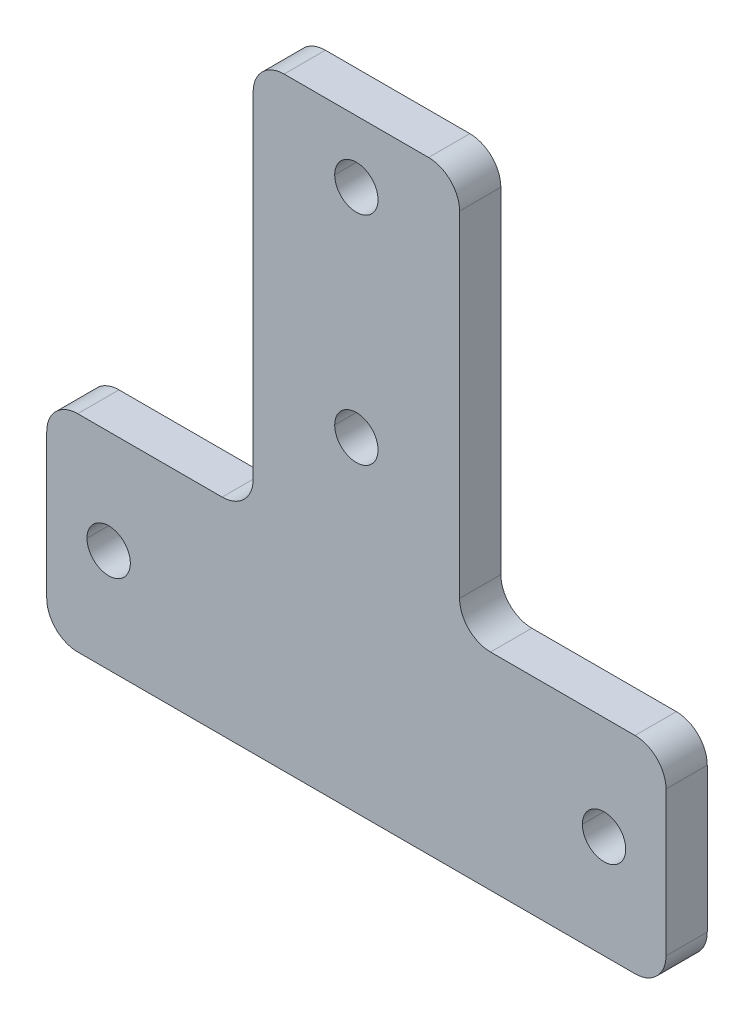
ISO-10303-21;
HEADER;
FILE_DESCRIPTION(('STEP AP214'),'2;1');
FILE_NAME('part.step','',(''),(''),'','','');
FILE_SCHEMA(('AUTOMOTIVE_DESIGN { 1 0 10303 214 1 1 1 1 }'));
ENDSEC;
DATA;
#1=APPLICATION_CONTEXT('core data for automotive mechanical design processes');
#2=APPLICATION_PROTOCOL_DEFINITION('international standard','automotive_design',2000,#1);
#3=PRODUCT_CONTEXT('',#1,'mechanical');
#4=PRODUCT('Part','Part','',(#3));
#5=PRODUCT_RELATED_PRODUCT_CATEGORY('part','',(#4));
#6=PRODUCT_DEFINITION_FORMATION('','',#4);
#7=PRODUCT_DEFINITION_CONTEXT('part definition',#1,'design');
#8=PRODUCT_DEFINITION('design','',#6,#7);
#9=PRODUCT_DEFINITION_SHAPE('','',#8);
#10=(LENGTH_UNIT() NAMED_UNIT(*) SI_UNIT(.MILLI.,.METRE.));
#11=(NAMED_UNIT(*) PLANE_ANGLE_UNIT() SI_UNIT($,.RADIAN.));
#12=(NAMED_UNIT(*) SI_UNIT($,.STERADIAN.) SOLID_ANGLE_UNIT());
#13=UNCERTAINTY_MEASURE_WITH_UNIT(LENGTH_MEASURE(1.E-05),#10,'distance_accuracy_value','');
#14=(GEOMETRIC_REPRESENTATION_CONTEXT(3) GLOBAL_UNCERTAINTY_ASSIGNED_CONTEXT((#13)) GLOBAL_UNIT_ASSIGNED_CONTEXT((#10,
#11,#12)) REPRESENTATION_CONTEXT('',''));
#15=CARTESIAN_POINT('',(0.,0.,0.));
#16=DIRECTION('',(0.,0.,1.));
#17=DIRECTION('',(1.,0.,0.));
#18=AXIS2_PLACEMENT_3D('',#15,#16,#17);
#19=CARTESIAN_POINT('',(12.999999999995,12.999999999967,-4.));
#20=DIRECTION('',(0.,0.,-1.));
#21=DIRECTION('',(-1.,0.,0.));
#22=AXIS2_PLACEMENT_3D('',#19,#20,#21);
#23=CYLINDRICAL_SURFACE('',#22,3.);
#24=CARTESIAN_POINT('',(12.999999999995,12.999999999967,-4.));
#25=DIRECTION('',(0.,0.,1.));
#26=DIRECTION('',(1.,0.,0.));
#27=AXIS2_PLACEMENT_3D('',#24,#25,#26);
#28=CIRCLE('',#27,3.);
#29=CARTESIAN_POINT('',(9.99999999999501,12.9999999999672,-4.));
#30=VERTEX_POINT('',#29);
#31=CARTESIAN_POINT('',(12.999999999995,9.99999999996703,-4.));
#32=VERTEX_POINT('',#31);
#33=EDGE_CURVE('E284',#30,#32,#28,.T.);
#34=ORIENTED_EDGE('',*,*,#33,.F.);
#35=DIRECTION('',(0.,0.,-1.));
#36=VECTOR('',#35,1.);
#37=CARTESIAN_POINT('',(9.99999999999501,12.9999999999672,-4.));
#38=LINE('',#37,#36);
#39=CARTESIAN_POINT('',(9.99999999999501,12.9999999999672,0.));
#40=VERTEX_POINT('',#39);
#41=EDGE_CURVE('E359',#40,#30,#38,.T.);
#42=ORIENTED_EDGE('',*,*,#41,.F.);
#43=CARTESIAN_POINT('',(12.999999999995,12.999999999967,0.));
#44=DIRECTION('',(0.,0.,-1.));
#45=DIRECTION('',(1.,0.,0.));
#46=AXIS2_PLACEMENT_3D('',#43,#44,#45);
#47=CIRCLE('',#46,3.);
#48=CARTESIAN_POINT('',(12.999999999995,9.99999999996703,0.));
#49=VERTEX_POINT('',#48);
#50=EDGE_CURVE('E432',#49,#40,#47,.T.);
#51=ORIENTED_EDGE('',*,*,#50,.F.);
#52=DIRECTION('',(0.,0.,1.));
#53=VECTOR('',#52,1.);
#54=CARTESIAN_POINT('',(12.999999999995,9.99999999996703,0.));
#55=LINE('',#54,#53);
#56=EDGE_CURVE('E388',#32,#49,#55,.T.);
#57=ORIENTED_EDGE('',*,*,#56,.F.);
#58=EDGE_LOOP('',(#34,#42,#51,#57));
#59=FACE_BOUND('',#58,.T.);
#60=ADVANCED_FACE('F17',(#59),#23,.F.);
#61=CARTESIAN_POINT('',(6.99999999999701,45.499999999995,-4.));
#62=DIRECTION('',(0.,0.,1.));
#63=DIRECTION('',(1.,0.,0.));
#64=AXIS2_PLACEMENT_3D('',#61,#62,#63);
#65=CYLINDRICAL_SURFACE('',#64,3.);
#66=CARTESIAN_POINT('',(6.99999999999701,45.499999999995,-4.));
#67=DIRECTION('',(0.,0.,-1.));
#68=DIRECTION('',(1.,1.8503717077086E-13,0.));
#69=AXIS2_PLACEMENT_3D('',#66,#67,#68);
#70=CIRCLE('',#69,3.);
#71=CARTESIAN_POINT('',(6.99999999999701,48.499999999995,-4.));
#72=VERTEX_POINT('',#71);
#73=CARTESIAN_POINT('',(9.99999999999701,45.4999999999948,-4.));
#74=VERTEX_POINT('',#73);
#75=EDGE_CURVE('E281',#72,#74,#70,.T.);
#76=ORIENTED_EDGE('',*,*,#75,.F.);
#77=DIRECTION('',(0.,0.,-1.));
#78=VECTOR('',#77,1.);
#79=CARTESIAN_POINT('',(6.99999999999701,48.499999999995,-4.));
#80=LINE('',#79,#78);
#81=CARTESIAN_POINT('',(6.99999999999701,48.499999999995,0.));
#82=VERTEX_POINT('',#81);
#83=EDGE_CURVE('E350',#82,#72,#80,.T.);
#84=ORIENTED_EDGE('',*,*,#83,.F.);
#85=CARTESIAN_POINT('',(6.99999999999701,45.499999999995,0.));
#86=DIRECTION('',(0.,0.,1.));
#87=DIRECTION('',(1.,0.,0.));
#88=AXIS2_PLACEMENT_3D('',#85,#86,#87);
#89=CIRCLE('',#88,3.);
#90=CARTESIAN_POINT('',(9.99999999999701,45.4999999999948,0.));
#91=VERTEX_POINT('',#90);
#92=EDGE_CURVE('E435',#91,#82,#89,.T.);
#93=ORIENTED_EDGE('',*,*,#92,.F.);
#94=DIRECTION('',(0.,0.,1.));
#95=VECTOR('',#94,1.);
#96=CARTESIAN_POINT('',(9.99999999999701,45.4999999999948,-4.));
#97=LINE('',#96,#95);
#98=EDGE_CURVE('E358',#74,#91,#97,.T.);
#99=ORIENTED_EDGE('',*,*,#98,.F.);
#100=EDGE_LOOP('',(#76,#84,#93,#99));
#101=FACE_BOUND('',#100,.T.);
#102=ADVANCED_FACE('F1067',(#101),#65,.T.);
#103=CARTESIAN_POINT('',(-6.99999999999362,45.499999999995,-4.));
#104=DIRECTION('',(0.,0.,1.));
#105=DIRECTION('',(1.,0.,0.));
#106=AXIS2_PLACEMENT_3D('',#103,#104,#105);
#107=CYLINDRICAL_SURFACE('',#106,3.);
#108=CARTESIAN_POINT('',(-6.99999999999362,45.499999999995,-4.));
#109=DIRECTION('',(0.,0.,-1.));
#110=DIRECTION('',(1.,0.,0.));
#111=AXIS2_PLACEMENT_3D('',#108,#109,#110);
#112=CIRCLE('',#111,3.);
#113=CARTESIAN_POINT('',(-9.99999999999362,45.4999999999949,-4.));
#114=VERTEX_POINT('',#113);
#115=CARTESIAN_POINT('',(-6.99999999999362,48.499999999995,-4.));
#116=VERTEX_POINT('',#115);
#117=EDGE_CURVE('E285',#114,#116,#112,.T.);
#118=ORIENTED_EDGE('',*,*,#117,.F.);
#119=DIRECTION('',(0.,0.,-1.));
#120=VECTOR('',#119,1.);
#121=CARTESIAN_POINT('',(-9.99999999999362,45.4999999999949,-4.));
#122=LINE('',#121,#120);
#123=CARTESIAN_POINT('',(-9.99999999999362,45.4999999999949,0.));
#124=VERTEX_POINT('',#123);
#125=EDGE_CURVE('E379',#124,#114,#122,.T.);
#126=ORIENTED_EDGE('',*,*,#125,.F.);
#127=CARTESIAN_POINT('',(-6.99999999999362,45.499999999995,0.));
#128=DIRECTION('',(0.,0.,1.));
#129=DIRECTION('',(1.,0.,0.));
#130=AXIS2_PLACEMENT_3D('',#127,#128,#129);
#131=CIRCLE('',#130,3.);
#132=CARTESIAN_POINT('',(-6.99999999999362,48.499999999995,0.));
#133=VERTEX_POINT('',#132);
#134=EDGE_CURVE('E38',#133,#124,#131,.T.);
#135=ORIENTED_EDGE('',*,*,#134,.F.);
#136=DIRECTION('',(0.,0.,1.));
#137=VECTOR('',#136,1.);
#138=CARTESIAN_POINT('',(-6.99999999999362,48.499999999995,-4.));
#139=LINE('',#138,#137);
#140=EDGE_CURVE('E332',#116,#133,#139,.T.);
#141=ORIENTED_EDGE('',*,*,#140,.F.);
#142=EDGE_LOOP('',(#118,#126,#135,#141));
#143=FACE_BOUND('',#142,.T.);
#144=ADVANCED_FACE('F958',(#143),#107,.T.);
#145=CARTESIAN_POINT('',(27.0000000000301,6.99999999996703,-4.));
#146=DIRECTION('',(0.,0.,1.));
#147=DIRECTION('',(1.,0.,0.));
#148=AXIS2_PLACEMENT_3D('',#145,#146,#147);
#149=CYLINDRICAL_SURFACE('',#148,3.);
#150=CARTESIAN_POINT('',(27.0000000000301,6.99999999996703,-4.));
#151=DIRECTION('',(0.,0.,-1.));
#152=DIRECTION('',(1.,0.,0.));
#153=AXIS2_PLACEMENT_3D('',#150,#151,#152);
#154=CIRCLE('',#153,3.);
#155=CARTESIAN_POINT('',(27.0000000000301,9.99999999996703,-4.));
#156=VERTEX_POINT('',#155);
#157=CARTESIAN_POINT('',(30.0000000000301,6.99999999996695,-4.));
#158=VERTEX_POINT('',#157);
#159=EDGE_CURVE('E478',#156,#158,#154,.T.);
#160=ORIENTED_EDGE('',*,*,#159,.F.);
#161=DIRECTION('',(0.,0.,-1.));
#162=VECTOR('',#161,1.);
#163=CARTESIAN_POINT('',(27.0000000000301,9.99999999996703,-4.));
#164=LINE('',#163,#162);
#165=CARTESIAN_POINT('',(27.0000000000301,9.99999999996703,0.));
#166=VERTEX_POINT('',#165);
#167=EDGE_CURVE('E374',#166,#156,#164,.T.);
#168=ORIENTED_EDGE('',*,*,#167,.F.);
#169=CARTESIAN_POINT('',(27.0000000000301,6.99999999996703,0.));
#170=DIRECTION('',(0.,0.,1.));
#171=DIRECTION('',(1.,0.,0.));
#172=AXIS2_PLACEMENT_3D('',#169,#170,#171);
#173=CIRCLE('',#172,3.);
#174=CARTESIAN_POINT('',(30.0000000000301,6.99999999996695,0.));
#175=VERTEX_POINT('',#174);
#176=EDGE_CURVE('E436',#175,#166,#173,.T.);
#177=ORIENTED_EDGE('',*,*,#176,.F.);
#178=DIRECTION('',(0.,0.,1.));
#179=VECTOR('',#178,1.);
#180=CARTESIAN_POINT('',(30.0000000000301,6.99999999996695,-4.));
#181=LINE('',#180,#179);
#182=EDGE_CURVE('E407',#158,#175,#181,.T.);
#183=ORIENTED_EDGE('',*,*,#182,.F.);
#184=EDGE_LOOP('',(#160,#168,#177,#183));
#185=FACE_BOUND('',#184,.T.);
#186=ADVANCED_FACE('F953',(#185),#149,.T.);
#187=CARTESIAN_POINT('',(27.0000000000297,-6.9999999999933,-4.));
#188=DIRECTION('',(0.,0.,1.));
#189=DIRECTION('',(1.,0.,0.));
#190=AXIS2_PLACEMENT_3D('',#187,#188,#189);
#191=CYLINDRICAL_SURFACE('',#190,3.);
#192=CARTESIAN_POINT('',(27.0000000000297,-6.9999999999933,-4.));
#193=DIRECTION('',(0.,0.,-1.));
#194=DIRECTION('',(1.,0.,0.));
#195=AXIS2_PLACEMENT_3D('',#192,#193,#194);
#196=CIRCLE('',#195,3.);
#197=CARTESIAN_POINT('',(30.0000000000297,-6.99999999999337,-4.));
#198=VERTEX_POINT('',#197);
#199=CARTESIAN_POINT('',(27.0000000000298,-9.99999999999329,-4.));
#200=VERTEX_POINT('',#199);
#201=EDGE_CURVE('E245',#198,#200,#196,.T.);
#202=ORIENTED_EDGE('',*,*,#201,.F.);
#203=DIRECTION('',(0.,0.,-1.));
#204=VECTOR('',#203,1.);
#205=CARTESIAN_POINT('',(30.0000000000297,-6.99999999999337,-4.));
#206=LINE('',#205,#204);
#207=CARTESIAN_POINT('',(30.0000000000297,-6.99999999999337,0.));
#208=VERTEX_POINT('',#207);
#209=EDGE_CURVE('E399',#208,#198,#206,.T.);
#210=ORIENTED_EDGE('',*,*,#209,.F.);
#211=CARTESIAN_POINT('',(27.0000000000297,-6.9999999999933,0.));
#212=DIRECTION('',(0.,0.,1.));
#213=DIRECTION('',(1.,0.,0.));
#214=AXIS2_PLACEMENT_3D('',#211,#212,#213);
#215=CIRCLE('',#214,3.);
#216=CARTESIAN_POINT('',(27.0000000000298,-9.99999999999329,0.));
#217=VERTEX_POINT('',#216);
#218=EDGE_CURVE('E319',#217,#208,#215,.T.);
#219=ORIENTED_EDGE('',*,*,#218,.F.);
#220=DIRECTION('',(0.,0.,1.));
#221=VECTOR('',#220,1.);
#222=CARTESIAN_POINT('',(27.0000000000298,-9.99999999999329,-4.));
#223=LINE('',#222,#221);
#224=EDGE_CURVE('E340',#200,#217,#223,.T.);
#225=ORIENTED_EDGE('',*,*,#224,.F.);
#226=EDGE_LOOP('',(#202,#210,#219,#225));
#227=FACE_BOUND('',#226,.T.);
#228=ADVANCED_FACE('F957',(#227),#191,.T.);
#229=CARTESIAN_POINT('',(-12.9999999999927,12.999999999967,-4.));
#230=DIRECTION('',(0.,0.,-1.));
#231=DIRECTION('',(-1.,0.,0.));
#232=AXIS2_PLACEMENT_3D('',#229,#230,#231);
#233=CYLINDRICAL_SURFACE('',#232,3.);
#234=CARTESIAN_POINT('',(-12.9999999999927,12.999999999967,-4.));
#235=DIRECTION('',(0.,0.,1.));
#236=DIRECTION('',(1.,0.,0.));
#237=AXIS2_PLACEMENT_3D('',#234,#235,#236);
#238=CIRCLE('',#237,3.);
#239=CARTESIAN_POINT('',(-12.9999999999927,9.99999999996703,-4.));
#240=VERTEX_POINT('',#239);
#241=CARTESIAN_POINT('',(-9.99999999999272,12.9999999999671,-4.));
#242=VERTEX_POINT('',#241);
#243=EDGE_CURVE('E454',#240,#242,#238,.T.);
#244=ORIENTED_EDGE('',*,*,#243,.F.);
#245=DIRECTION('',(0.,0.,-1.));
#246=VECTOR('',#245,1.);
#247=CARTESIAN_POINT('',(-12.9999999999927,9.99999999996703,-4.));
#248=LINE('',#247,#246);
#249=CARTESIAN_POINT('',(-12.9999999999927,9.99999999996703,0.));
#250=VERTEX_POINT('',#249);
#251=EDGE_CURVE('E449',#250,#240,#248,.T.);
#252=ORIENTED_EDGE('',*,*,#251,.F.);
#253=CARTESIAN_POINT('',(-12.9999999999927,12.999999999967,0.));
#254=DIRECTION('',(0.,0.,-1.));
#255=DIRECTION('',(1.,0.,0.));
#256=AXIS2_PLACEMENT_3D('',#253,#254,#255);
#257=CIRCLE('',#256,3.);
#258=CARTESIAN_POINT('',(-9.99999999999272,12.9999999999671,0.));
#259=VERTEX_POINT('',#258);
#260=EDGE_CURVE('E49',#259,#250,#257,.T.);
#261=ORIENTED_EDGE('',*,*,#260,.F.);
#262=DIRECTION('',(0.,0.,1.));
#263=VECTOR('',#262,1.);
#264=CARTESIAN_POINT('',(-9.99999999999272,12.9999999999671,0.));
#265=LINE('',#264,#263);
#266=EDGE_CURVE('E395',#242,#259,#265,.T.);
#267=ORIENTED_EDGE('',*,*,#266,.F.);
#268=EDGE_LOOP('',(#244,#252,#261,#267));
#269=FACE_BOUND('',#268,.T.);
#270=ADVANCED_FACE('F993',(#269),#233,.F.);
#271=CARTESIAN_POINT('',(-26.9999999999716,6.99999999996703,-4.));
#272=DIRECTION('',(0.,0.,1.));
#273=DIRECTION('',(1.,0.,0.));
#274=AXIS2_PLACEMENT_3D('',#271,#272,#273);
#275=CYLINDRICAL_SURFACE('',#274,3.);
#276=CARTESIAN_POINT('',(-26.9999999999716,6.99999999996703,-4.));
#277=DIRECTION('',(0.,0.,-1.));
#278=DIRECTION('',(1.,0.,0.));
#279=AXIS2_PLACEMENT_3D('',#276,#277,#278);
#280=CIRCLE('',#279,3.);
#281=CARTESIAN_POINT('',(-29.9999999999716,6.99999999996716,-4.));
#282=VERTEX_POINT('',#281);
#283=CARTESIAN_POINT('',(-26.9999999999716,9.99999999996703,-4.));
#284=VERTEX_POINT('',#283);
#285=EDGE_CURVE('E457',#282,#284,#280,.T.);
#286=ORIENTED_EDGE('',*,*,#285,.F.);
#287=DIRECTION('',(0.,0.,-1.));
#288=VECTOR('',#287,1.);
#289=CARTESIAN_POINT('',(-29.9999999999716,6.99999999996716,-4.));
#290=LINE('',#289,#288);
#291=CARTESIAN_POINT('',(-29.9999999999716,6.99999999996716,0.));
#292=VERTEX_POINT('',#291);
#293=EDGE_CURVE('E266',#292,#282,#290,.T.);
#294=ORIENTED_EDGE('',*,*,#293,.F.);
#295=CARTESIAN_POINT('',(-26.9999999999716,6.99999999996703,0.));
#296=DIRECTION('',(0.,0.,1.));
#297=DIRECTION('',(1.,0.,0.));
#298=AXIS2_PLACEMENT_3D('',#295,#296,#297);
#299=CIRCLE('',#298,3.);
#300=CARTESIAN_POINT('',(-26.9999999999716,9.99999999996703,0.));
#301=VERTEX_POINT('',#300);
#302=EDGE_CURVE('E431',#301,#292,#299,.T.);
#303=ORIENTED_EDGE('',*,*,#302,.F.);
#304=DIRECTION('',(0.,0.,1.));
#305=VECTOR('',#304,1.);
#306=CARTESIAN_POINT('',(-26.9999999999716,9.99999999996703,-4.));
#307=LINE('',#306,#305);
#308=EDGE_CURVE('E441',#284,#301,#307,.T.);
#309=ORIENTED_EDGE('',*,*,#308,.F.);
#310=EDGE_LOOP('',(#286,#294,#303,#309));
#311=FACE_BOUND('',#310,.T.);
#312=ADVANCED_FACE('F1036',(#311),#275,.T.);
#313=CARTESIAN_POINT('',(-26.9999999999722,-6.99999999999534,-4.));
#314=DIRECTION('',(0.,0.,1.));
#315=DIRECTION('',(1.,0.,0.));
#316=AXIS2_PLACEMENT_3D('',#313,#314,#315);
#317=CYLINDRICAL_SURFACE('',#316,3.);
#318=CARTESIAN_POINT('',(-26.9999999999722,-6.99999999999534,-4.));
#319=DIRECTION('',(0.,0.,-1.));
#320=DIRECTION('',(1.,0.,0.));
#321=AXIS2_PLACEMENT_3D('',#318,#319,#320);
#322=CIRCLE('',#321,3.);
#323=CARTESIAN_POINT('',(-26.9999999999721,-9.99999999999534,-4.));
#324=VERTEX_POINT('',#323);
#325=CARTESIAN_POINT('',(-29.9999999999722,-6.99999999999521,-4.));
#326=VERTEX_POINT('',#325);
#327=EDGE_CURVE('E383',#324,#326,#322,.T.);
#328=ORIENTED_EDGE('',*,*,#327,.F.);
#329=DIRECTION('',(0.,0.,-1.));
#330=VECTOR('',#329,1.);
#331=CARTESIAN_POINT('',(-26.9999999999721,-9.99999999999534,-4.));
#332=LINE('',#331,#330);
#333=CARTESIAN_POINT('',(-26.9999999999721,-9.99999999999534,0.));
#334=VERTEX_POINT('',#333);
#335=EDGE_CURVE('E418',#334,#324,#332,.T.);
#336=ORIENTED_EDGE('',*,*,#335,.F.);
#337=CARTESIAN_POINT('',(-26.9999999999722,-6.99999999999534,0.));
#338=DIRECTION('',(0.,0.,1.));
#339=DIRECTION('',(1.,0.,0.));
#340=AXIS2_PLACEMENT_3D('',#337,#338,#339);
#341=CIRCLE('',#340,3.);
#342=CARTESIAN_POINT('',(-29.9999999999722,-6.99999999999521,0.));
#343=VERTEX_POINT('',#342);
#344=EDGE_CURVE('E316',#343,#334,#341,.T.);
#345=ORIENTED_EDGE('',*,*,#344,.F.);
#346=DIRECTION('',(0.,0.,1.));
#347=VECTOR('',#346,1.);
#348=CARTESIAN_POINT('',(-29.9999999999722,-6.99999999999521,-4.));
#349=LINE('',#348,#347);
#350=EDGE_CURVE('E306',#326,#343,#349,.T.);
#351=ORIENTED_EDGE('',*,*,#350,.F.);
#352=EDGE_LOOP('',(#328,#336,#345,#351));
#353=FACE_BOUND('',#352,.T.);
#354=ADVANCED_FACE('F1032',(#353),#317,.T.);
#355=CARTESIAN_POINT('',(24.0000000000022,0.,-4.));
#356=DIRECTION('',(0.,0.,1.));
#357=DIRECTION('',(1.,0.,0.));
#358=AXIS2_PLACEMENT_3D('',#355,#356,#357);
#359=CYLINDRICAL_SURFACE('',#358,2.1);
#360=DIRECTION('',(0.,0.,1.));
#361=VECTOR('',#360,1.);
#362=CARTESIAN_POINT('',(21.9000000000022,0.,-4.));
#363=LINE('',#362,#361);
#364=CARTESIAN_POINT('',(21.9000000000022,0.,-4.));
#365=VERTEX_POINT('',#364);
#366=CARTESIAN_POINT('',(21.9000000000022,0.,0.));
#367=VERTEX_POINT('',#366);
#368=EDGE_CURVE('E248',#365,#367,#363,.T.);
#369=ORIENTED_EDGE('',*,*,#368,.F.);
#370=CARTESIAN_POINT('',(24.0000000000022,0.,-4.));
#371=DIRECTION('',(0.,0.,1.));
#372=DIRECTION('',(1.,0.,0.));
#373=AXIS2_PLACEMENT_3D('',#370,#371,#372);
#374=CIRCLE('',#373,2.1);
#375=CARTESIAN_POINT('',(26.1000000000022,0.,-4.));
#376=VERTEX_POINT('',#375);
#377=EDGE_CURVE('E234',#376,#365,#374,.T.);
#378=ORIENTED_EDGE('',*,*,#377,.F.);
#379=DIRECTION('',(0.,0.,1.));
#380=VECTOR('',#379,1.);
#381=CARTESIAN_POINT('',(26.1000000000022,0.,-4.));
#382=LINE('',#381,#380);
#383=CARTESIAN_POINT('',(26.1000000000022,0.,0.));
#384=VERTEX_POINT('',#383);
#385=EDGE_CURVE('E258',#376,#384,#382,.T.);
#386=ORIENTED_EDGE('',*,*,#385,.T.);
#387=CARTESIAN_POINT('',(24.0000000000022,0.,0.));
#388=DIRECTION('',(0.,0.,1.));
#389=DIRECTION('',(1.,0.,0.));
#390=AXIS2_PLACEMENT_3D('',#387,#388,#389);
#391=CIRCLE('',#390,2.1);
#392=EDGE_CURVE('E250',#384,#367,#391,.T.);
#393=ORIENTED_EDGE('',*,*,#392,.T.);
#394=EDGE_LOOP('',(#369,#378,#386,#393));
#395=FACE_BOUND('',#394,.T.);
#396=ADVANCED_FACE('F249',(#395),#359,.F.);
#397=CARTESIAN_POINT('',(-23.9999999999987,0.,-4.));
#398=DIRECTION('',(0.,0.,1.));
#399=DIRECTION('',(1.,0.,0.));
#400=AXIS2_PLACEMENT_3D('',#397,#398,#399);
#401=CYLINDRICAL_SURFACE('',#400,2.1);
#402=DIRECTION('',(0.,0.,1.));
#403=VECTOR('',#402,1.);
#404=CARTESIAN_POINT('',(-26.0999999999987,0.,-4.));
#405=LINE('',#404,#403);
#406=CARTESIAN_POINT('',(-26.0999999999987,0.,-4.));
#407=VERTEX_POINT('',#406);
#408=CARTESIAN_POINT('',(-26.0999999999987,0.,0.));
#409=VERTEX_POINT('',#408);
#410=EDGE_CURVE('E267',#407,#409,#405,.T.);
#411=ORIENTED_EDGE('',*,*,#410,.F.);
#412=CARTESIAN_POINT('',(-23.9999999999987,0.,-4.));
#413=DIRECTION('',(0.,0.,1.));
#414=DIRECTION('',(1.,0.,0.));
#415=AXIS2_PLACEMENT_3D('',#412,#413,#414);
#416=CIRCLE('',#415,2.1);
#417=CARTESIAN_POINT('',(-21.8999999999987,0.,-4.));
#418=VERTEX_POINT('',#417);
#419=EDGE_CURVE('E244',#418,#407,#416,.T.);
#420=ORIENTED_EDGE('',*,*,#419,.F.);
#421=DIRECTION('',(0.,0.,1.));
#422=VECTOR('',#421,1.);
#423=CARTESIAN_POINT('',(-21.8999999999987,0.,-4.));
#424=LINE('',#423,#422);
#425=CARTESIAN_POINT('',(-21.8999999999987,0.,0.));
#426=VERTEX_POINT('',#425);
#427=EDGE_CURVE('E276',#418,#426,#424,.T.);
#428=ORIENTED_EDGE('',*,*,#427,.T.);
#429=CARTESIAN_POINT('',(-23.9999999999987,0.,0.));
#430=DIRECTION('',(0.,0.,1.));
#431=DIRECTION('',(1.,0.,0.));
#432=AXIS2_PLACEMENT_3D('',#429,#430,#431);
#433=CIRCLE('',#432,2.1);
#434=EDGE_CURVE('E470',#426,#409,#433,.T.);
#435=ORIENTED_EDGE('',*,*,#434,.T.);
#436=EDGE_LOOP('',(#411,#420,#428,#435));
#437=FACE_BOUND('',#436,.T.);
#438=ADVANCED_FACE('F1018',(#437),#401,.F.);
#439=CARTESIAN_POINT('',(0.,21.5000000000016,-4.));
#440=DIRECTION('',(0.,0.,1.));
#441=DIRECTION('',(1.,0.,0.));
#442=AXIS2_PLACEMENT_3D('',#439,#440,#441);
#443=CYLINDRICAL_SURFACE('',#442,2.1);
#444=DIRECTION('',(0.,0.,1.));
#445=VECTOR('',#444,1.);
#446=CARTESIAN_POINT('',(-2.10000000000004,21.5000000000016,-4.));
#447=LINE('',#446,#445);
#448=CARTESIAN_POINT('',(-2.10000000000004,21.5000000000016,-4.));
#449=VERTEX_POINT('',#448);
#450=CARTESIAN_POINT('',(-2.10000000000004,21.5000000000016,0.));
#451=VERTEX_POINT('',#450);
#452=EDGE_CURVE('E294',#449,#451,#447,.T.);
#453=ORIENTED_EDGE('',*,*,#452,.F.);
#454=CARTESIAN_POINT('',(0.,21.5000000000016,-4.));
#455=DIRECTION('',(0.,0.,1.));
#456=DIRECTION('',(1.,0.,0.));
#457=AXIS2_PLACEMENT_3D('',#454,#455,#456);
#458=CIRCLE('',#457,2.1);
#459=CARTESIAN_POINT('',(2.09999999999996,21.5000000000016,-4.));
#460=VERTEX_POINT('',#459);
#461=EDGE_CURVE('E473',#460,#449,#458,.T.);
#462=ORIENTED_EDGE('',*,*,#461,.F.);
#463=DIRECTION('',(0.,0.,1.));
#464=VECTOR('',#463,1.);
#465=CARTESIAN_POINT('',(2.09999999999996,21.5000000000016,-4.));
#466=LINE('',#465,#464);
#467=CARTESIAN_POINT('',(2.09999999999996,21.5000000000016,0.));
#468=VERTEX_POINT('',#467);
#469=EDGE_CURVE('E293',#460,#468,#466,.T.);
#470=ORIENTED_EDGE('',*,*,#469,.T.);
#471=CARTESIAN_POINT('',(0.,21.5000000000016,0.));
#472=DIRECTION('',(0.,0.,1.));
#473=DIRECTION('',(1.,0.,0.));
#474=AXIS2_PLACEMENT_3D('',#471,#472,#473);
#475=CIRCLE('',#474,2.1);
#476=EDGE_CURVE('E25',#468,#451,#475,.T.);
#477=ORIENTED_EDGE('',*,*,#476,.T.);
#478=EDGE_LOOP('',(#453,#462,#470,#477));
#479=FACE_BOUND('',#478,.T.);
#480=ADVANCED_FACE('F911',(#479),#443,.F.);
#481=CARTESIAN_POINT('',(0.,42.4999999999949,-4.));
#482=DIRECTION('',(0.,0.,1.));
#483=DIRECTION('',(1.,0.,0.));
#484=AXIS2_PLACEMENT_3D('',#481,#482,#483);
#485=CYLINDRICAL_SURFACE('',#484,2.1);
#486=DIRECTION('',(0.,0.,1.));
#487=VECTOR('',#486,1.);
#488=CARTESIAN_POINT('',(-2.10000000000007,42.4999999999949,-4.));
#489=LINE('',#488,#487);
#490=CARTESIAN_POINT('',(-2.10000000000007,42.4999999999949,-4.));
#491=VERTEX_POINT('',#490);
#492=CARTESIAN_POINT('',(-2.10000000000007,42.4999999999949,0.));
#493=VERTEX_POINT('',#492);
#494=EDGE_CURVE('E328',#491,#493,#489,.T.);
#495=ORIENTED_EDGE('',*,*,#494,.F.);
#496=CARTESIAN_POINT('',(0.,42.4999999999949,-4.));
#497=DIRECTION('',(0.,0.,1.));
#498=DIRECTION('',(1.,0.,0.));
#499=AXIS2_PLACEMENT_3D('',#496,#497,#498);
#500=CIRCLE('',#499,2.1);
#501=CARTESIAN_POINT('',(2.09999999999993,42.4999999999949,-4.));
#502=VERTEX_POINT('',#501);
#503=EDGE_CURVE('E320',#502,#491,#500,.T.);
#504=ORIENTED_EDGE('',*,*,#503,.F.);
#505=DIRECTION('',(0.,0.,1.));
#506=VECTOR('',#505,1.);
#507=CARTESIAN_POINT('',(2.09999999999993,42.4999999999949,-4.));
#508=LINE('',#507,#506);
#509=CARTESIAN_POINT('',(2.09999999999993,42.4999999999949,0.));
#510=VERTEX_POINT('',#509);
#511=EDGE_CURVE('E310',#502,#510,#508,.T.);
#512=ORIENTED_EDGE('',*,*,#511,.T.);
#513=CARTESIAN_POINT('',(0.,42.4999999999949,0.));
#514=DIRECTION('',(0.,0.,1.));
#515=DIRECTION('',(1.,0.,0.));
#516=AXIS2_PLACEMENT_3D('',#513,#514,#515);
#517=CIRCLE('',#516,2.1);
#518=EDGE_CURVE('E11',#510,#493,#517,.T.);
#519=ORIENTED_EDGE('',*,*,#518,.T.);
#520=EDGE_LOOP('',(#495,#504,#512,#519));
#521=FACE_BOUND('',#520,.T.);
#522=ADVANCED_FACE('F907',(#521),#485,.F.);
#523=CARTESIAN_POINT('',(0.,0.,0.));
#524=DIRECTION('',(0.,0.,1.));
#525=DIRECTION('',(1.,0.,0.));
#526=AXIS2_PLACEMENT_3D('',#523,#524,#525);
#527=PLANE('',#526);
#528=ORIENTED_EDGE('',*,*,#518,.F.);
#529=CARTESIAN_POINT('',(0.,42.4999999999949,0.));
#530=DIRECTION('',(0.,0.,1.));
#531=DIRECTION('',(1.,0.,0.));
#532=AXIS2_PLACEMENT_3D('',#529,#530,#531);
#533=CIRCLE('',#532,2.1);
#534=EDGE_CURVE('E315',#493,#510,#533,.T.);
#535=ORIENTED_EDGE('',*,*,#534,.F.);
#536=EDGE_LOOP('',(#528,#535));
#537=FACE_BOUND('',#536,.T.);
#538=ORIENTED_EDGE('',*,*,#476,.F.);
#539=CARTESIAN_POINT('',(0.,21.5000000000016,0.));
#540=DIRECTION('',(0.,0.,1.));
#541=DIRECTION('',(1.,0.,0.));
#542=AXIS2_PLACEMENT_3D('',#539,#540,#541);
#543=CIRCLE('',#542,2.1);
#544=EDGE_CURVE('E289',#451,#468,#543,.T.);
#545=ORIENTED_EDGE('',*,*,#544,.F.);
#546=EDGE_LOOP('',(#538,#545));
#547=FACE_BOUND('',#546,.T.);
#548=ORIENTED_EDGE('',*,*,#434,.F.);
#549=CARTESIAN_POINT('',(-23.9999999999987,0.,0.));
#550=DIRECTION('',(0.,0.,1.));
#551=DIRECTION('',(1.,0.,0.));
#552=AXIS2_PLACEMENT_3D('',#549,#550,#551);
#553=CIRCLE('',#552,2.1);
#554=EDGE_CURVE('E270',#409,#426,#553,.T.);
#555=ORIENTED_EDGE('',*,*,#554,.F.);
#556=EDGE_LOOP('',(#548,#555));
#557=FACE_BOUND('',#556,.T.);
#558=ORIENTED_EDGE('',*,*,#392,.F.);
#559=CARTESIAN_POINT('',(24.0000000000022,0.,0.));
#560=DIRECTION('',(0.,0.,1.));
#561=DIRECTION('',(1.,0.,0.));
#562=AXIS2_PLACEMENT_3D('',#559,#560,#561);
#563=CIRCLE('',#562,2.1);
#564=EDGE_CURVE('E255',#367,#384,#563,.T.);
#565=ORIENTED_EDGE('',*,*,#564,.F.);
#566=EDGE_LOOP('',(#558,#565));
#567=FACE_BOUND('',#566,.T.);
#568=DIRECTION('',(0.,-1.,0.));
#569=VECTOR('',#568,1.);
#570=CARTESIAN_POINT('',(-29.9999999999723,-9.99999999999546,0.));
#571=LINE('',#570,#569);
#572=EDGE_CURVE('E302',#292,#343,#571,.T.);
#573=ORIENTED_EDGE('',*,*,#572,.T.);
#574=ORIENTED_EDGE('',*,*,#344,.T.);
#575=DIRECTION('',(1.,0.,0.));
#576=VECTOR('',#575,1.);
#577=CARTESIAN_POINT('',(-29.9999999999723,-9.99999999999546,0.));
#578=LINE('',#577,#576);
#579=EDGE_CURVE('E411',#334,#217,#578,.T.);
#580=ORIENTED_EDGE('',*,*,#579,.T.);
#581=ORIENTED_EDGE('',*,*,#218,.T.);
#582=DIRECTION('',(0.,1.,0.));
#583=VECTOR('',#582,1.);
#584=CARTESIAN_POINT('',(30.0000000000296,-9.99999999999318,0.));
#585=LINE('',#584,#583);
#586=EDGE_CURVE('E392',#208,#175,#585,.T.);
#587=ORIENTED_EDGE('',*,*,#586,.T.);
#588=ORIENTED_EDGE('',*,*,#176,.T.);
#589=DIRECTION('',(-1.,0.,0.));
#590=VECTOR('',#589,1.);
#591=CARTESIAN_POINT('',(9.99999999999482,9.99999999996703,0.));
#592=LINE('',#591,#590);
#593=EDGE_CURVE('E363',#166,#49,#592,.T.);
#594=ORIENTED_EDGE('',*,*,#593,.T.);
#595=ORIENTED_EDGE('',*,*,#50,.T.);
#596=DIRECTION('',(0.,1.,0.));
#597=VECTOR('',#596,1.);
#598=CARTESIAN_POINT('',(9.99999999999482,9.99999999996703,0.));
#599=LINE('',#598,#597);
#600=EDGE_CURVE('E364',#40,#91,#599,.T.);
#601=ORIENTED_EDGE('',*,*,#600,.T.);
#602=ORIENTED_EDGE('',*,*,#92,.T.);
#603=DIRECTION('',(-1.,0.,0.));
#604=VECTOR('',#603,1.);
#605=CARTESIAN_POINT('',(-9.99999999999371,48.499999999995,0.));
#606=LINE('',#605,#604);
#607=EDGE_CURVE('E347',#82,#133,#606,.T.);
#608=ORIENTED_EDGE('',*,*,#607,.T.);
#609=ORIENTED_EDGE('',*,*,#134,.T.);
#610=DIRECTION('',(0.,-1.,0.));
#611=VECTOR('',#610,1.);
#612=CARTESIAN_POINT('',(-9.99999999999264,9.99999999996703,0.));
#613=LINE('',#612,#611);
#614=EDGE_CURVE('E384',#124,#259,#613,.T.);
#615=ORIENTED_EDGE('',*,*,#614,.T.);
#616=ORIENTED_EDGE('',*,*,#260,.T.);
#617=DIRECTION('',(-1.,0.,0.));
#618=VECTOR('',#617,1.);
#619=CARTESIAN_POINT('',(-29.9999999999715,9.99999999996703,0.));
#620=LINE('',#619,#618);
#621=EDGE_CURVE('E445',#250,#301,#620,.T.);
#622=ORIENTED_EDGE('',*,*,#621,.T.);
#623=ORIENTED_EDGE('',*,*,#302,.T.);
#624=EDGE_LOOP('',(#573,#574,#580,#581,#587,#588,#594,#595,#601,#602,#608,#609,#615,#616,#622,#623));
#625=FACE_BOUND('',#624,.T.);
#626=ADVANCED_FACE('F901',(#537,#547,#557,#567,#625),#527,.T.);
#627=CARTESIAN_POINT('',(0.,0.,-4.));
#628=DIRECTION('',(0.,0.,1.));
#629=DIRECTION('',(1.,0.,0.));
#630=AXIS2_PLACEMENT_3D('',#627,#628,#629);
#631=PLANE('',#630);
#632=ORIENTED_EDGE('',*,*,#503,.T.);
#633=CARTESIAN_POINT('',(0.,42.4999999999949,-4.));
#634=DIRECTION('',(0.,0.,1.));
#635=DIRECTION('',(1.,0.,0.));
#636=AXIS2_PLACEMENT_3D('',#633,#634,#635);
#637=CIRCLE('',#636,2.1);
#638=EDGE_CURVE('E324',#491,#502,#637,.T.);
#639=ORIENTED_EDGE('',*,*,#638,.T.);
#640=EDGE_LOOP('',(#632,#639));
#641=FACE_BOUND('',#640,.T.);
#642=ORIENTED_EDGE('',*,*,#461,.T.);
#643=CARTESIAN_POINT('',(0.,21.5000000000016,-4.));
#644=DIRECTION('',(0.,0.,1.));
#645=DIRECTION('',(1.,0.,0.));
#646=AXIS2_PLACEMENT_3D('',#643,#644,#645);
#647=CIRCLE('',#646,2.1);
#648=EDGE_CURVE('E298',#449,#460,#647,.T.);
#649=ORIENTED_EDGE('',*,*,#648,.T.);
#650=EDGE_LOOP('',(#642,#649));
#651=FACE_BOUND('',#650,.T.);
#652=ORIENTED_EDGE('',*,*,#419,.T.);
#653=CARTESIAN_POINT('',(-23.9999999999987,0.,-4.));
#654=DIRECTION('',(0.,0.,1.));
#655=DIRECTION('',(1.,0.,0.));
#656=AXIS2_PLACEMENT_3D('',#653,#654,#655);
#657=CIRCLE('',#656,2.1);
#658=EDGE_CURVE('E271',#407,#418,#657,.T.);
#659=ORIENTED_EDGE('',*,*,#658,.T.);
#660=EDGE_LOOP('',(#652,#659));
#661=FACE_BOUND('',#660,.T.);
#662=ORIENTED_EDGE('',*,*,#377,.T.);
#663=CARTESIAN_POINT('',(24.0000000000022,0.,-4.));
#664=DIRECTION('',(0.,0.,1.));
#665=DIRECTION('',(1.,0.,0.));
#666=AXIS2_PLACEMENT_3D('',#663,#664,#665);
#667=CIRCLE('',#666,2.1);
#668=EDGE_CURVE('E239',#365,#376,#667,.T.);
#669=ORIENTED_EDGE('',*,*,#668,.T.);
#670=EDGE_LOOP('',(#662,#669));
#671=FACE_BOUND('',#670,.T.);
#672=DIRECTION('',(1.,0.,0.));
#673=VECTOR('',#672,1.);
#674=CARTESIAN_POINT('',(-29.9999999999723,-9.99999999999546,-4.));
#675=LINE('',#674,#673);
#676=EDGE_CURVE('E422',#324,#200,#675,.T.);
#677=ORIENTED_EDGE('',*,*,#676,.F.);
#678=ORIENTED_EDGE('',*,*,#327,.T.);
#679=DIRECTION('',(0.,-1.,0.));
#680=VECTOR('',#679,1.);
#681=CARTESIAN_POINT('',(-29.9999999999723,-9.99999999999546,-4.));
#682=LINE('',#681,#680);
#683=EDGE_CURVE('E336',#282,#326,#682,.T.);
#684=ORIENTED_EDGE('',*,*,#683,.F.);
#685=ORIENTED_EDGE('',*,*,#285,.T.);
#686=DIRECTION('',(-1.,0.,0.));
#687=VECTOR('',#686,1.);
#688=CARTESIAN_POINT('',(-29.9999999999715,9.99999999996703,-4.));
#689=LINE('',#688,#687);
#690=EDGE_CURVE('E437',#240,#284,#689,.T.);
#691=ORIENTED_EDGE('',*,*,#690,.F.);
#692=ORIENTED_EDGE('',*,*,#243,.T.);
#693=DIRECTION('',(0.,-1.,0.));
#694=VECTOR('',#693,1.);
#695=CARTESIAN_POINT('',(-9.99999999999264,9.99999999996703,-4.));
#696=LINE('',#695,#694);
#697=EDGE_CURVE('E453',#114,#242,#696,.T.);
#698=ORIENTED_EDGE('',*,*,#697,.F.);
#699=ORIENTED_EDGE('',*,*,#117,.T.);
#700=DIRECTION('',(-1.,0.,0.));
#701=VECTOR('',#700,1.);
#702=CARTESIAN_POINT('',(-9.99999999999371,48.499999999995,-4.));
#703=LINE('',#702,#701);
#704=EDGE_CURVE('E314',#72,#116,#703,.T.);
#705=ORIENTED_EDGE('',*,*,#704,.F.);
#706=ORIENTED_EDGE('',*,*,#75,.T.);
#707=DIRECTION('',(0.,1.,0.));
#708=VECTOR('',#707,1.);
#709=CARTESIAN_POINT('',(9.99999999999482,9.99999999996703,-4.));
#710=LINE('',#709,#708);
#711=EDGE_CURVE('E354',#30,#74,#710,.T.);
#712=ORIENTED_EDGE('',*,*,#711,.F.);
#713=ORIENTED_EDGE('',*,*,#33,.T.);
#714=DIRECTION('',(-1.,0.,0.));
#715=VECTOR('',#714,1.);
#716=CARTESIAN_POINT('',(9.99999999999482,9.99999999996703,-4.));
#717=LINE('',#716,#715);
#718=EDGE_CURVE('E378',#156,#32,#717,.T.);
#719=ORIENTED_EDGE('',*,*,#718,.F.);
#720=ORIENTED_EDGE('',*,*,#159,.T.);
#721=DIRECTION('',(0.,1.,0.));
#722=VECTOR('',#721,1.);
#723=CARTESIAN_POINT('',(30.0000000000296,-9.99999999999318,-4.));
#724=LINE('',#723,#722);
#725=EDGE_CURVE('E403',#198,#158,#724,.T.);
#726=ORIENTED_EDGE('',*,*,#725,.F.);
#727=ORIENTED_EDGE('',*,*,#201,.T.);
#728=EDGE_LOOP('',(#677,#678,#684,#685,#691,#692,#698,#699,#705,#706,#712,#713,#719,#720,#726,#727));
#729=FACE_BOUND('',#728,.T.);
#730=ADVANCED_FACE('F236',(#641,#651,#661,#671,#729),#631,.F.);
#731=CARTESIAN_POINT('',(-9.99999999999264,9.99999999996703,-4.));
#732=DIRECTION('',(-1.,0.,0.));
#733=DIRECTION('',(0.,1.,0.));
#734=AXIS2_PLACEMENT_3D('',#731,#732,#733);
#735=PLANE('',#734);
#736=ORIENTED_EDGE('',*,*,#697,.T.);
#737=ORIENTED_EDGE('',*,*,#266,.T.);
#738=ORIENTED_EDGE('',*,*,#614,.F.);
#739=ORIENTED_EDGE('',*,*,#125,.T.);
#740=EDGE_LOOP('',(#736,#737,#738,#739));
#741=FACE_BOUND('',#740,.T.);
#742=ADVANCED_FACE('F879',(#741),#735,.T.);
#743=CARTESIAN_POINT('',(-29.9999999999715,9.99999999996703,-4.));
#744=DIRECTION('',(0.,1.,0.));
#745=DIRECTION('',(1.,0.,0.));
#746=AXIS2_PLACEMENT_3D('',#743,#744,#745);
#747=PLANE('',#746);
#748=ORIENTED_EDGE('',*,*,#690,.T.);
#749=ORIENTED_EDGE('',*,*,#308,.T.);
#750=ORIENTED_EDGE('',*,*,#621,.F.);
#751=ORIENTED_EDGE('',*,*,#251,.T.);
#752=EDGE_LOOP('',(#748,#749,#750,#751));
#753=FACE_BOUND('',#752,.T.);
#754=ADVANCED_FACE('F883',(#753),#747,.T.);
#755=CARTESIAN_POINT('',(-29.9999999999723,-9.99999999999546,-4.));
#756=DIRECTION('',(-1.,0.,0.));
#757=DIRECTION('',(0.,0.,1.));
#758=AXIS2_PLACEMENT_3D('',#755,#756,#757);
#759=PLANE('',#758);
#760=ORIENTED_EDGE('',*,*,#683,.T.);
#761=ORIENTED_EDGE('',*,*,#350,.T.);
#762=ORIENTED_EDGE('',*,*,#572,.F.);
#763=ORIENTED_EDGE('',*,*,#293,.T.);
#764=EDGE_LOOP('',(#760,#761,#762,#763));
#765=FACE_BOUND('',#764,.T.);
#766=ADVANCED_FACE('F920',(#765),#759,.T.);
#767=CARTESIAN_POINT('',(-29.9999999999723,-9.99999999999546,-4.));
#768=DIRECTION('',(0.,-1.,0.));
#769=DIRECTION('',(0.,0.,-1.));
#770=AXIS2_PLACEMENT_3D('',#767,#768,#769);
#771=PLANE('',#770);
#772=ORIENTED_EDGE('',*,*,#579,.F.);
#773=ORIENTED_EDGE('',*,*,#335,.T.);
#774=ORIENTED_EDGE('',*,*,#676,.T.);
#775=ORIENTED_EDGE('',*,*,#224,.T.);
#776=EDGE_LOOP('',(#772,#773,#774,#775));
#777=FACE_BOUND('',#776,.T.);
#778=ADVANCED_FACE('F976',(#777),#771,.T.);
#779=CARTESIAN_POINT('',(30.0000000000296,-9.99999999999318,-4.));
#780=DIRECTION('',(1.,0.,0.));
#781=DIRECTION('',(0.,-1.,0.));
#782=AXIS2_PLACEMENT_3D('',#779,#780,#781);
#783=PLANE('',#782);
#784=ORIENTED_EDGE('',*,*,#586,.F.);
#785=ORIENTED_EDGE('',*,*,#209,.T.);
#786=ORIENTED_EDGE('',*,*,#725,.T.);
#787=ORIENTED_EDGE('',*,*,#182,.T.);
#788=EDGE_LOOP('',(#784,#785,#786,#787));
#789=FACE_BOUND('',#788,.T.);
#790=ADVANCED_FACE('F967',(#789),#783,.T.);
#791=CARTESIAN_POINT('',(9.99999999999482,9.99999999996703,-4.));
#792=DIRECTION('',(0.,1.,0.));
#793=DIRECTION('',(1.,0.,0.));
#794=AXIS2_PLACEMENT_3D('',#791,#792,#793);
#795=PLANE('',#794);
#796=ORIENTED_EDGE('',*,*,#593,.F.);
#797=ORIENTED_EDGE('',*,*,#167,.T.);
#798=ORIENTED_EDGE('',*,*,#718,.T.);
#799=ORIENTED_EDGE('',*,*,#56,.T.);
#800=EDGE_LOOP('',(#796,#797,#798,#799));
#801=FACE_BOUND('',#800,.T.);
#802=ADVANCED_FACE('F947',(#801),#795,.T.);
#803=CARTESIAN_POINT('',(9.99999999999482,9.99999999996703,-4.));
#804=DIRECTION('',(1.,0.,0.));
#805=DIRECTION('',(0.,-1.,0.));
#806=AXIS2_PLACEMENT_3D('',#803,#804,#805);
#807=PLANE('',#806);
#808=ORIENTED_EDGE('',*,*,#711,.T.);
#809=ORIENTED_EDGE('',*,*,#98,.T.);
#810=ORIENTED_EDGE('',*,*,#600,.F.);
#811=ORIENTED_EDGE('',*,*,#41,.T.);
#812=EDGE_LOOP('',(#808,#809,#810,#811));
#813=FACE_BOUND('',#812,.T.);
#814=ADVANCED_FACE('F938',(#813),#807,.T.);
#815=CARTESIAN_POINT('',(-9.99999999999371,48.499999999995,-4.));
#816=DIRECTION('',(0.,1.,0.));
#817=DIRECTION('',(1.,0.,0.));
#818=AXIS2_PLACEMENT_3D('',#815,#816,#817);
#819=PLANE('',#818);
#820=ORIENTED_EDGE('',*,*,#704,.T.);
#821=ORIENTED_EDGE('',*,*,#140,.T.);
#822=ORIENTED_EDGE('',*,*,#607,.F.);
#823=ORIENTED_EDGE('',*,*,#83,.T.);
#824=EDGE_LOOP('',(#820,#821,#822,#823));
#825=FACE_BOUND('',#824,.T.);
#826=ADVANCED_FACE('F929',(#825),#819,.T.);
#827=CARTESIAN_POINT('',(0.,42.4999999999949,-4.));
#828=DIRECTION('',(0.,0.,1.));
#829=DIRECTION('',(1.,0.,0.));
#830=AXIS2_PLACEMENT_3D('',#827,#828,#829);
#831=CYLINDRICAL_SURFACE('',#830,2.1);
#832=ORIENTED_EDGE('',*,*,#638,.F.);
#833=ORIENTED_EDGE('',*,*,#494,.T.);
#834=ORIENTED_EDGE('',*,*,#534,.T.);
#835=ORIENTED_EDGE('',*,*,#511,.F.);
#836=EDGE_LOOP('',(#832,#833,#834,#835));
#837=FACE_BOUND('',#836,.T.);
#838=ADVANCED_FACE('F892',(#837),#831,.F.);
#839=CARTESIAN_POINT('',(0.,21.5000000000016,-4.));
#840=DIRECTION('',(0.,0.,1.));
#841=DIRECTION('',(1.,0.,0.));
#842=AXIS2_PLACEMENT_3D('',#839,#840,#841);
#843=CYLINDRICAL_SURFACE('',#842,2.1);
#844=ORIENTED_EDGE('',*,*,#648,.F.);
#845=ORIENTED_EDGE('',*,*,#452,.T.);
#846=ORIENTED_EDGE('',*,*,#544,.T.);
#847=ORIENTED_EDGE('',*,*,#469,.F.);
#848=EDGE_LOOP('',(#844,#845,#846,#847));
#849=FACE_BOUND('',#848,.T.);
#850=ADVANCED_FACE('F873',(#849),#843,.F.);
#851=CARTESIAN_POINT('',(-23.9999999999987,0.,-4.));
#852=DIRECTION('',(0.,0.,1.));
#853=DIRECTION('',(1.,0.,0.));
#854=AXIS2_PLACEMENT_3D('',#851,#852,#853);
#855=CYLINDRICAL_SURFACE('',#854,2.1);
#856=ORIENTED_EDGE('',*,*,#658,.F.);
#857=ORIENTED_EDGE('',*,*,#410,.T.);
#858=ORIENTED_EDGE('',*,*,#554,.T.);
#859=ORIENTED_EDGE('',*,*,#427,.F.);
#860=EDGE_LOOP('',(#856,#857,#858,#859));
#861=FACE_BOUND('',#860,.T.);
#862=ADVANCED_FACE('F865',(#861),#855,.F.);
#863=CARTESIAN_POINT('',(24.0000000000022,0.,-4.));
#864=DIRECTION('',(0.,0.,1.));
#865=DIRECTION('',(1.,0.,0.));
#866=AXIS2_PLACEMENT_3D('',#863,#864,#865);
#867=CYLINDRICAL_SURFACE('',#866,2.1);
#868=ORIENTED_EDGE('',*,*,#668,.F.);
#869=ORIENTED_EDGE('',*,*,#368,.T.);
#870=ORIENTED_EDGE('',*,*,#564,.T.);
#871=ORIENTED_EDGE('',*,*,#385,.F.);
#872=EDGE_LOOP('',(#868,#869,#870,#871));
#873=FACE_BOUND('',#872,.T.);
#874=ADVANCED_FACE('F257',(#873),#867,.F.);
#875=CLOSED_SHELL('',(#60,#102,#144,#186,#228,#270,#312,#354,#396,#438,#480,#522,#626,#730,#742,
#754,#766,#778,#790,#802,#814,#826,#838,#850,#862,#874));
#876=MANIFOLD_SOLID_BREP('B1',#875);
#877=ADVANCED_BREP_SHAPE_REPRESENTATION('',(#18,#876),#14);
#878=SHAPE_DEFINITION_REPRESENTATION(#9,#877);
ENDSEC;
END-ISO-10303-21;
